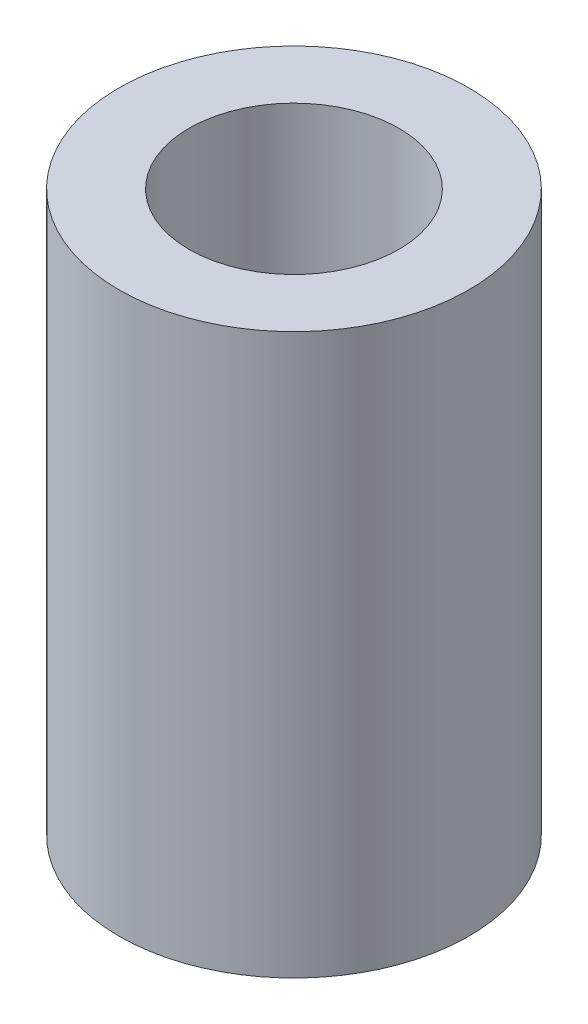
ISO-10303-21;
HEADER;
FILE_DESCRIPTION(('STEP AP214'),'2;1');
FILE_NAME('part.step','',(''),(''),'','','');
FILE_SCHEMA(('AUTOMOTIVE_DESIGN { 1 0 10303 214 1 1 1 1 }'));
ENDSEC;
DATA;
#1=APPLICATION_CONTEXT('core data for automotive mechanical design processes');
#2=APPLICATION_PROTOCOL_DEFINITION('international standard','automotive_design',2000,#1);
#3=PRODUCT_CONTEXT('',#1,'mechanical');
#4=PRODUCT('Part','Part','',(#3));
#5=PRODUCT_RELATED_PRODUCT_CATEGORY('part','',(#4));
#6=PRODUCT_DEFINITION_FORMATION('','',#4);
#7=PRODUCT_DEFINITION_CONTEXT('part definition',#1,'design');
#8=PRODUCT_DEFINITION('design','',#6,#7);
#9=PRODUCT_DEFINITION_SHAPE('','',#8);
#10=(LENGTH_UNIT() NAMED_UNIT(*) SI_UNIT(.MILLI.,.METRE.));
#11=(NAMED_UNIT(*) PLANE_ANGLE_UNIT() SI_UNIT($,.RADIAN.));
#12=(NAMED_UNIT(*) SI_UNIT($,.STERADIAN.) SOLID_ANGLE_UNIT());
#13=UNCERTAINTY_MEASURE_WITH_UNIT(LENGTH_MEASURE(1.E-05),#10,'distance_accuracy_value','');
#14=(GEOMETRIC_REPRESENTATION_CONTEXT(3) GLOBAL_UNCERTAINTY_ASSIGNED_CONTEXT((#13)) GLOBAL_UNIT_ASSIGNED_CONTEXT((#10,
#11,#12)) REPRESENTATION_CONTEXT('',''));
#15=CARTESIAN_POINT('',(0.,0.,0.));
#16=DIRECTION('',(0.,0.,1.));
#17=DIRECTION('',(1.,0.,0.));
#18=AXIS2_PLACEMENT_3D('',#15,#16,#17);
#19=CARTESIAN_POINT('',(-0.488949405282451,-8.,-0.114567217811705));
#20=DIRECTION('',(0.,1.,0.));
#21=DIRECTION('',(0.,0.,1.));
#22=AXIS2_PLACEMENT_3D('',#19,#20,#21);
#23=CYLINDRICAL_SURFACE('',#22,2.5);
#24=CARTESIAN_POINT('',(-0.488949405282451,-8.,-0.114567217811705));
#25=DIRECTION('',(0.,1.,0.));
#26=DIRECTION('',(0.,0.,1.));
#27=AXIS2_PLACEMENT_3D('',#24,#25,#26);
#28=CIRCLE('',#27,2.5);
#29=CARTESIAN_POINT('',(-0.488949405282451,-8.,2.38543278218829));
#30=VERTEX_POINT('',#29);
#31=EDGE_CURVE('E10',#30,#30,#28,.T.);
#32=ORIENTED_EDGE('',*,*,#31,.T.);
#33=EDGE_LOOP('',(#32));
#34=FACE_BOUND('',#33,.T.);
#35=CARTESIAN_POINT('',(-0.488949405282451,0.,-0.114567217811705));
#36=DIRECTION('',(0.,1.,0.));
#37=DIRECTION('',(0.,0.,1.));
#38=AXIS2_PLACEMENT_3D('',#35,#36,#37);
#39=CIRCLE('',#38,2.5);
#40=CARTESIAN_POINT('',(-0.488949405282451,0.,2.38543278218829));
#41=VERTEX_POINT('',#40);
#42=EDGE_CURVE('E33',#41,#41,#39,.T.);
#43=ORIENTED_EDGE('',*,*,#42,.F.);
#44=EDGE_LOOP('',(#43));
#45=FACE_BOUND('',#44,.T.);
#46=ADVANCED_FACE('F30',(#34,#45),#23,.T.);
#47=CARTESIAN_POINT('',(-0.488949405282451,-8.,-0.114567217811705));
#48=DIRECTION('',(0.,1.,0.));
#49=DIRECTION('',(0.,0.,1.));
#50=AXIS2_PLACEMENT_3D('',#47,#48,#49);
#51=PLANE('',#50);
#52=CARTESIAN_POINT('',(-0.488949405282451,-8.,-0.114567217811705));
#53=DIRECTION('',(0.,1.,0.));
#54=DIRECTION('',(0.,0.,1.));
#55=AXIS2_PLACEMENT_3D('',#52,#53,#54);
#56=CIRCLE('',#55,1.5);
#57=CARTESIAN_POINT('',(-0.488949405282451,-8.,1.3854327821883));
#58=VERTEX_POINT('',#57);
#59=EDGE_CURVE('E40',#58,#58,#56,.T.);
#60=ORIENTED_EDGE('',*,*,#59,.T.);
#61=EDGE_LOOP('',(#60));
#62=FACE_BOUND('',#61,.T.);
#63=ORIENTED_EDGE('',*,*,#31,.F.);
#64=EDGE_LOOP('',(#63));
#65=FACE_BOUND('',#64,.T.);
#66=ADVANCED_FACE('F48',(#62,#65),#51,.F.);
#67=CARTESIAN_POINT('',(-0.488949405282451,0.,-0.114567217811705));
#68=DIRECTION('',(0.,1.,0.));
#69=DIRECTION('',(0.,0.,1.));
#70=AXIS2_PLACEMENT_3D('',#67,#68,#69);
#71=PLANE('',#70);
#72=CARTESIAN_POINT('',(-0.488949405282451,0.,-0.114567217811705));
#73=DIRECTION('',(0.,1.,0.));
#74=DIRECTION('',(0.,0.,1.));
#75=AXIS2_PLACEMENT_3D('',#72,#73,#74);
#76=CIRCLE('',#75,1.5);
#77=CARTESIAN_POINT('',(-0.488949405282451,0.,1.3854327821883));
#78=VERTEX_POINT('',#77);
#79=EDGE_CURVE('E42',#78,#78,#76,.T.);
#80=ORIENTED_EDGE('',*,*,#79,.F.);
#81=EDGE_LOOP('',(#80));
#82=FACE_BOUND('',#81,.T.);
#83=ORIENTED_EDGE('',*,*,#42,.T.);
#84=EDGE_LOOP('',(#83));
#85=FACE_BOUND('',#84,.T.);
#86=ADVANCED_FACE('F54',(#82,#85),#71,.T.);
#87=CARTESIAN_POINT('',(-0.488949405282451,-8.,-0.114567217811705));
#88=DIRECTION('',(0.,1.,0.));
#89=DIRECTION('',(0.,0.,1.));
#90=AXIS2_PLACEMENT_3D('',#87,#88,#89);
#91=CYLINDRICAL_SURFACE('',#90,1.5);
#92=ORIENTED_EDGE('',*,*,#59,.F.);
#93=EDGE_LOOP('',(#92));
#94=FACE_BOUND('',#93,.T.);
#95=ORIENTED_EDGE('',*,*,#79,.T.);
#96=EDGE_LOOP('',(#95));
#97=FACE_BOUND('',#96,.T.);
#98=ADVANCED_FACE('F51',(#94,#97),#91,.F.);
#99=CLOSED_SHELL('',(#46,#66,#86,#98));
#100=MANIFOLD_SOLID_BREP('B2',#99);
#101=ADVANCED_BREP_SHAPE_REPRESENTATION('',(#18,#100),#14);
#102=SHAPE_DEFINITION_REPRESENTATION(#9,#101);
ENDSEC;
END-ISO-10303-21;
